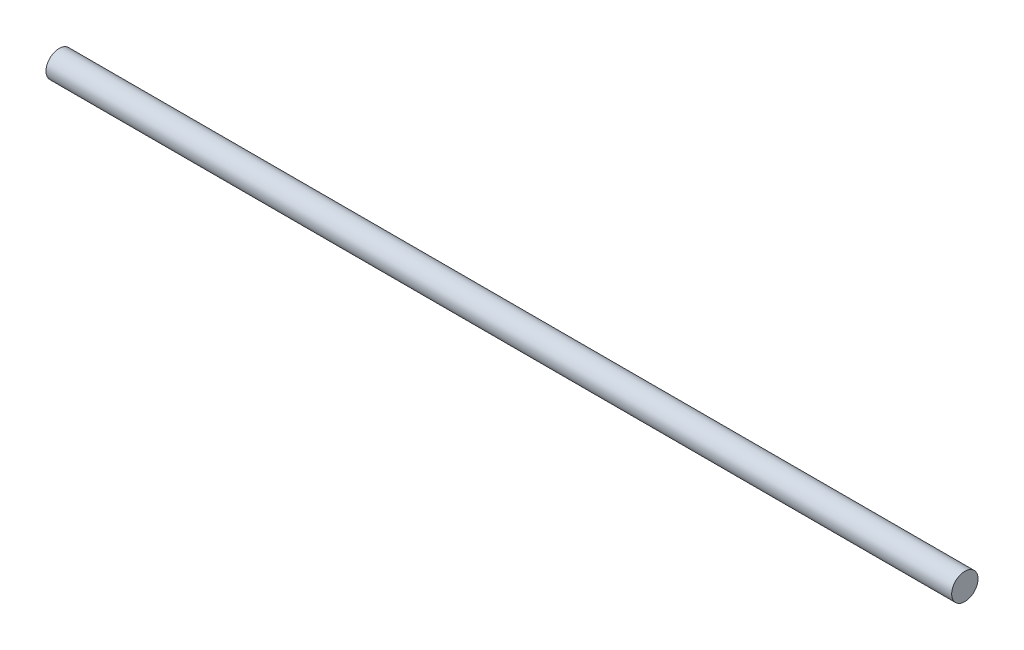
ISO-10303-21;
HEADER;
FILE_DESCRIPTION(('STEP AP214'),'2;1');
FILE_NAME('part.step','',(''),(''),'','','');
FILE_SCHEMA(('AUTOMOTIVE_DESIGN { 1 0 10303 214 1 1 1 1 }'));
ENDSEC;
DATA;
#1=APPLICATION_CONTEXT('core data for automotive mechanical design processes');
#2=APPLICATION_PROTOCOL_DEFINITION('international standard','automotive_design',2000,#1);
#3=PRODUCT_CONTEXT('',#1,'mechanical');
#4=PRODUCT('Part','Part','',(#3));
#5=PRODUCT_RELATED_PRODUCT_CATEGORY('part','',(#4));
#6=PRODUCT_DEFINITION_FORMATION('','',#4);
#7=PRODUCT_DEFINITION_CONTEXT('part definition',#1,'design');
#8=PRODUCT_DEFINITION('design','',#6,#7);
#9=PRODUCT_DEFINITION_SHAPE('','',#8);
#10=(LENGTH_UNIT() NAMED_UNIT(*) SI_UNIT(.MILLI.,.METRE.));
#11=(NAMED_UNIT(*) PLANE_ANGLE_UNIT() SI_UNIT($,.RADIAN.));
#12=(NAMED_UNIT(*) SI_UNIT($,.STERADIAN.) SOLID_ANGLE_UNIT());
#13=UNCERTAINTY_MEASURE_WITH_UNIT(LENGTH_MEASURE(1.E-05),#10,'distance_accuracy_value','');
#14=(GEOMETRIC_REPRESENTATION_CONTEXT(3) GLOBAL_UNCERTAINTY_ASSIGNED_CONTEXT((#13)) GLOBAL_UNIT_ASSIGNED_CONTEXT((#10,
#11,#12)) REPRESENTATION_CONTEXT('',''));
#15=CARTESIAN_POINT('',(0.,0.,0.));
#16=DIRECTION('',(0.,0.,1.));
#17=DIRECTION('',(1.,0.,0.));
#18=AXIS2_PLACEMENT_3D('',#15,#16,#17);
#19=CARTESIAN_POINT('',(120.426281562392,-276.062087489054,21.2678193082412));
#20=DIRECTION('',(-1.,0.,0.));
#21=DIRECTION('',(0.,-1.,0.));
#22=AXIS2_PLACEMENT_3D('',#19,#20,#21);
#23=CYLINDRICAL_SURFACE('',#22,3.17499999999999);
#24=CARTESIAN_POINT('',(120.426281562392,-276.062087489054,21.2678193082412));
#25=DIRECTION('',(1.,0.,0.));
#26=DIRECTION('',(0.,1.,0.));
#27=AXIS2_PLACEMENT_3D('',#24,#25,#26);
#28=CIRCLE('',#27,3.17499999999999);
#29=CARTESIAN_POINT('',(120.426281562392,-272.887087489054,21.2678193082412));
#30=VERTEX_POINT('',#29);
#31=EDGE_CURVE('E11',#30,#30,#28,.T.);
#32=ORIENTED_EDGE('',*,*,#31,.F.);
#33=EDGE_LOOP('',(#32));
#34=FACE_BOUND('',#33,.T.);
#35=CARTESIAN_POINT('',(-98.013718437608,-276.062087489054,21.2678193082412));
#36=DIRECTION('',(1.,0.,0.));
#37=DIRECTION('',(0.,1.,0.));
#38=AXIS2_PLACEMENT_3D('',#35,#36,#37);
#39=CIRCLE('',#38,3.17499999999999);
#40=CARTESIAN_POINT('',(-98.013718437608,-272.887087489054,21.2678193082412));
#41=VERTEX_POINT('',#40);
#42=EDGE_CURVE('E48',#41,#41,#39,.T.);
#43=ORIENTED_EDGE('',*,*,#42,.T.);
#44=EDGE_LOOP('',(#43));
#45=FACE_BOUND('',#44,.T.);
#46=ADVANCED_FACE('F45',(#34,#45),#23,.T.);
#47=CARTESIAN_POINT('',(120.426281562392,-276.062087489054,21.2678193082412));
#48=DIRECTION('',(1.,0.,0.));
#49=DIRECTION('',(0.,1.,0.));
#50=AXIS2_PLACEMENT_3D('',#47,#48,#49);
#51=PLANE('',#50);
#52=ORIENTED_EDGE('',*,*,#31,.T.);
#53=EDGE_LOOP('',(#52));
#54=FACE_BOUND('',#53,.T.);
#55=ADVANCED_FACE('F60',(#54),#51,.T.);
#56=CARTESIAN_POINT('',(-98.013718437608,-276.062087489054,21.2678193082412));
#57=DIRECTION('',(1.,0.,0.));
#58=DIRECTION('',(0.,1.,0.));
#59=AXIS2_PLACEMENT_3D('',#56,#57,#58);
#60=PLANE('',#59);
#61=ORIENTED_EDGE('',*,*,#42,.F.);
#62=EDGE_LOOP('',(#61));
#63=FACE_BOUND('',#62,.T.);
#64=ADVANCED_FACE('F58',(#63),#60,.F.);
#65=CLOSED_SHELL('',(#46,#55,#64));
#66=MANIFOLD_SOLID_BREP('B2',#65);
#67=ADVANCED_BREP_SHAPE_REPRESENTATION('',(#18,#66),#14);
#68=SHAPE_DEFINITION_REPRESENTATION(#9,#67);
ENDSEC;
END-ISO-10303-21;
